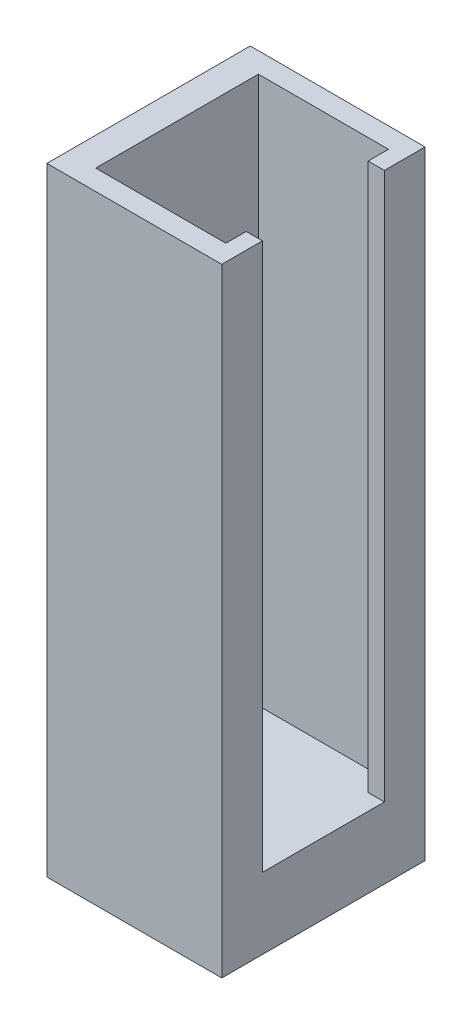
ISO-10303-21;
HEADER;
FILE_DESCRIPTION(('STEP AP214'),'2;1');
FILE_NAME('part.step','',(''),(''),'','','');
FILE_SCHEMA(('AUTOMOTIVE_DESIGN { 1 0 10303 214 1 1 1 1 }'));
ENDSEC;
DATA;
#1=APPLICATION_CONTEXT('core data for automotive mechanical design processes');
#2=APPLICATION_PROTOCOL_DEFINITION('international standard','automotive_design',2000,#1);
#3=PRODUCT_CONTEXT('',#1,'mechanical');
#4=PRODUCT('Part','Part','',(#3));
#5=PRODUCT_RELATED_PRODUCT_CATEGORY('part','',(#4));
#6=PRODUCT_DEFINITION_FORMATION('','',#4);
#7=PRODUCT_DEFINITION_CONTEXT('part definition',#1,'design');
#8=PRODUCT_DEFINITION('design','',#6,#7);
#9=PRODUCT_DEFINITION_SHAPE('','',#8);
#10=(LENGTH_UNIT() NAMED_UNIT(*) SI_UNIT(.MILLI.,.METRE.));
#11=(NAMED_UNIT(*) PLANE_ANGLE_UNIT() SI_UNIT($,.RADIAN.));
#12=(NAMED_UNIT(*) SI_UNIT($,.STERADIAN.) SOLID_ANGLE_UNIT());
#13=UNCERTAINTY_MEASURE_WITH_UNIT(LENGTH_MEASURE(1.E-05),#10,'distance_accuracy_value','');
#14=(GEOMETRIC_REPRESENTATION_CONTEXT(3) GLOBAL_UNCERTAINTY_ASSIGNED_CONTEXT((#13)) GLOBAL_UNIT_ASSIGNED_CONTEXT((#10,
#11,#12)) REPRESENTATION_CONTEXT('',''));
#15=CARTESIAN_POINT('',(0.,0.,0.));
#16=DIRECTION('',(0.,0.,1.));
#17=DIRECTION('',(1.,0.,0.));
#18=AXIS2_PLACEMENT_3D('',#15,#16,#17);
#19=CARTESIAN_POINT('',(-2.15,0.,2.5));
#20=DIRECTION('',(1.,0.,0.));
#21=DIRECTION('',(0.,0.,-1.));
#22=AXIS2_PLACEMENT_3D('',#19,#20,#21);
#23=PLANE('',#22);
#24=DIRECTION('',(0.,-1.,0.));
#25=VECTOR('',#24,1.);
#26=CARTESIAN_POINT('',(-2.15,0.,-2.5));
#27=LINE('',#26,#25);
#28=CARTESIAN_POINT('',(-2.15,15.2,-2.5));
#29=VERTEX_POINT('',#28);
#30=CARTESIAN_POINT('',(-2.15,0.,-2.5));
#31=VERTEX_POINT('',#30);
#32=EDGE_CURVE('E167',#29,#31,#27,.T.);
#33=ORIENTED_EDGE('',*,*,#32,.T.);
#34=DIRECTION('',(0.,0.,-1.));
#35=VECTOR('',#34,1.);
#36=CARTESIAN_POINT('',(-2.15,0.,2.5));
#37=LINE('',#36,#35);
#38=CARTESIAN_POINT('',(-2.15,0.,2.5));
#39=VERTEX_POINT('',#38);
#40=EDGE_CURVE('E11',#39,#31,#37,.T.);
#41=ORIENTED_EDGE('',*,*,#40,.F.);
#42=DIRECTION('',(0.,-1.,0.));
#43=VECTOR('',#42,1.);
#44=CARTESIAN_POINT('',(-2.15,0.,2.5));
#45=LINE('',#44,#43);
#46=CARTESIAN_POINT('',(-2.15,15.2,2.5));
#47=VERTEX_POINT('',#46);
#48=EDGE_CURVE('E161',#47,#39,#45,.T.);
#49=ORIENTED_EDGE('',*,*,#48,.F.);
#50=DIRECTION('',(0.,0.,-1.));
#51=VECTOR('',#50,1.);
#52=CARTESIAN_POINT('',(-2.15,15.2,2.5));
#53=LINE('',#52,#51);
#54=EDGE_CURVE('E157',#47,#29,#53,.T.);
#55=ORIENTED_EDGE('',*,*,#54,.T.);
#56=EDGE_LOOP('',(#33,#41,#49,#55));
#57=FACE_BOUND('',#56,.T.);
#58=ADVANCED_FACE('F36',(#57),#23,.F.);
#59=CARTESIAN_POINT('',(-2.15,0.,2.5));
#60=DIRECTION('',(0.,1.,0.));
#61=DIRECTION('',(-1.,0.,0.));
#62=AXIS2_PLACEMENT_3D('',#59,#60,#61);
#63=PLANE('',#62);
#64=DIRECTION('',(1.,0.,0.));
#65=VECTOR('',#64,1.);
#66=CARTESIAN_POINT('',(-2.15,0.,-2.5));
#67=LINE('',#66,#65);
#68=CARTESIAN_POINT('',(2.15,0.,-2.5));
#69=VERTEX_POINT('',#68);
#70=EDGE_CURVE('E165',#31,#69,#67,.T.);
#71=ORIENTED_EDGE('',*,*,#70,.T.);
#72=DIRECTION('',(0.,0.,-1.));
#73=VECTOR('',#72,1.);
#74=CARTESIAN_POINT('',(2.15,0.,2.5));
#75=LINE('',#74,#73);
#76=CARTESIAN_POINT('',(2.15,0.,2.5));
#77=VERTEX_POINT('',#76);
#78=EDGE_CURVE('E43',#77,#69,#75,.T.);
#79=ORIENTED_EDGE('',*,*,#78,.F.);
#80=DIRECTION('',(1.,0.,0.));
#81=VECTOR('',#80,1.);
#82=CARTESIAN_POINT('',(-2.15,0.,2.5));
#83=LINE('',#82,#81);
#84=EDGE_CURVE('E86',#39,#77,#83,.T.);
#85=ORIENTED_EDGE('',*,*,#84,.F.);
#86=ORIENTED_EDGE('',*,*,#40,.T.);
#87=EDGE_LOOP('',(#71,#79,#85,#86));
#88=FACE_BOUND('',#87,.T.);
#89=ADVANCED_FACE('F249',(#88),#63,.F.);
#90=CARTESIAN_POINT('',(2.15,0.,2.5));
#91=DIRECTION('',(-1.,0.,0.));
#92=DIRECTION('',(0.,0.,1.));
#93=AXIS2_PLACEMENT_3D('',#90,#91,#92);
#94=PLANE('',#93);
#95=DIRECTION('',(0.,0.,-1.));
#96=VECTOR('',#95,1.);
#97=CARTESIAN_POINT('',(2.15,15.2,2.5));
#98=LINE('',#97,#96);
#99=CARTESIAN_POINT('',(2.15,15.2,-1.5));
#100=VERTEX_POINT('',#99);
#101=CARTESIAN_POINT('',(2.15,15.2,-2.5));
#102=VERTEX_POINT('',#101);
#103=EDGE_CURVE('E154',#100,#102,#98,.T.);
#104=ORIENTED_EDGE('',*,*,#103,.F.);
#105=DIRECTION('',(0.,-1.,0.));
#106=VECTOR('',#105,1.);
#107=CARTESIAN_POINT('',(2.15,15.2,-1.5));
#108=LINE('',#107,#106);
#109=CARTESIAN_POINT('',(2.15,1.75,-1.5));
#110=VERTEX_POINT('',#109);
#111=EDGE_CURVE('E170',#100,#110,#108,.T.);
#112=ORIENTED_EDGE('',*,*,#111,.T.);
#113=DIRECTION('',(0.,0.,1.));
#114=VECTOR('',#113,1.);
#115=CARTESIAN_POINT('',(2.15,1.75,-1.5));
#116=LINE('',#115,#114);
#117=CARTESIAN_POINT('',(2.15,1.75,1.5));
#118=VERTEX_POINT('',#117);
#119=EDGE_CURVE('E149',#110,#118,#116,.T.);
#120=ORIENTED_EDGE('',*,*,#119,.T.);
#121=DIRECTION('',(0.,-1.,0.));
#122=VECTOR('',#121,1.);
#123=CARTESIAN_POINT('',(2.15,15.2,1.5));
#124=LINE('',#123,#122);
#125=CARTESIAN_POINT('',(2.15,15.2,1.5));
#126=VERTEX_POINT('',#125);
#127=EDGE_CURVE('E135',#126,#118,#124,.T.);
#128=ORIENTED_EDGE('',*,*,#127,.F.);
#129=CARTESIAN_POINT('',(2.15,15.2,2.5));
#130=VERTEX_POINT('',#129);
#131=EDGE_CURVE('E147',#130,#126,#98,.T.);
#132=ORIENTED_EDGE('',*,*,#131,.F.);
#133=DIRECTION('',(0.,1.,0.));
#134=VECTOR('',#133,1.);
#135=CARTESIAN_POINT('',(2.15,0.,2.5));
#136=LINE('',#135,#134);
#137=EDGE_CURVE('E172',#77,#130,#136,.T.);
#138=ORIENTED_EDGE('',*,*,#137,.F.);
#139=ORIENTED_EDGE('',*,*,#78,.T.);
#140=DIRECTION('',(0.,1.,0.));
#141=VECTOR('',#140,1.);
#142=CARTESIAN_POINT('',(2.15,0.,-2.5));
#143=LINE('',#142,#141);
#144=EDGE_CURVE('E162',#69,#102,#143,.T.);
#145=ORIENTED_EDGE('',*,*,#144,.T.);
#146=EDGE_LOOP('',(#104,#112,#120,#128,#132,#138,#139,#145));
#147=FACE_BOUND('',#146,.T.);
#148=ADVANCED_FACE('F145',(#147),#94,.F.);
#149=CARTESIAN_POINT('',(-2.15,15.2,2.5));
#150=DIRECTION('',(0.,-1.,0.));
#151=DIRECTION('',(0.,0.,-1.));
#152=AXIS2_PLACEMENT_3D('',#149,#150,#151);
#153=PLANE('',#152);
#154=DIRECTION('',(0.,0.,1.));
#155=VECTOR('',#154,1.);
#156=CARTESIAN_POINT('',(1.75,15.2,-2.));
#157=LINE('',#156,#155);
#158=CARTESIAN_POINT('',(1.75,15.2,-2.));
#159=VERTEX_POINT('',#158);
#160=CARTESIAN_POINT('',(1.75,15.2,-1.5));
#161=VERTEX_POINT('',#160);
#162=EDGE_CURVE('E210',#159,#161,#157,.T.);
#163=ORIENTED_EDGE('',*,*,#162,.T.);
#164=DIRECTION('',(1.,0.,0.));
#165=VECTOR('',#164,1.);
#166=CARTESIAN_POINT('',(1.75,15.2,-1.5));
#167=LINE('',#166,#165);
#168=EDGE_CURVE('E150',#161,#100,#167,.T.);
#169=ORIENTED_EDGE('',*,*,#168,.T.);
#170=ORIENTED_EDGE('',*,*,#103,.T.);
#171=DIRECTION('',(-1.,0.,0.));
#172=VECTOR('',#171,1.);
#173=CARTESIAN_POINT('',(-2.15,15.2,-2.5));
#174=LINE('',#173,#172);
#175=EDGE_CURVE('E79',#102,#29,#174,.T.);
#176=ORIENTED_EDGE('',*,*,#175,.T.);
#177=ORIENTED_EDGE('',*,*,#54,.F.);
#178=DIRECTION('',(-1.,0.,0.));
#179=VECTOR('',#178,1.);
#180=CARTESIAN_POINT('',(-2.15,15.2,2.5));
#181=LINE('',#180,#179);
#182=EDGE_CURVE('E59',#130,#47,#181,.T.);
#183=ORIENTED_EDGE('',*,*,#182,.F.);
#184=ORIENTED_EDGE('',*,*,#131,.T.);
#185=DIRECTION('',(-1.,0.,0.));
#186=VECTOR('',#185,1.);
#187=CARTESIAN_POINT('',(2.15,15.2,1.5));
#188=LINE('',#187,#186);
#189=CARTESIAN_POINT('',(1.75,15.2,1.5));
#190=VERTEX_POINT('',#189);
#191=EDGE_CURVE('E131',#126,#190,#188,.T.);
#192=ORIENTED_EDGE('',*,*,#191,.T.);
#193=DIRECTION('',(0.,0.,1.));
#194=VECTOR('',#193,1.);
#195=CARTESIAN_POINT('',(1.75,15.2,1.5));
#196=LINE('',#195,#194);
#197=CARTESIAN_POINT('',(1.75,15.2,2.));
#198=VERTEX_POINT('',#197);
#199=EDGE_CURVE('E50',#190,#198,#196,.T.);
#200=ORIENTED_EDGE('',*,*,#199,.T.);
#201=DIRECTION('',(-1.,0.,0.));
#202=VECTOR('',#201,1.);
#203=CARTESIAN_POINT('',(1.75,15.2,2.));
#204=LINE('',#203,#202);
#205=CARTESIAN_POINT('',(-1.45,15.2,2.));
#206=VERTEX_POINT('',#205);
#207=EDGE_CURVE('E218',#198,#206,#204,.T.);
#208=ORIENTED_EDGE('',*,*,#207,.T.);
#209=DIRECTION('',(0.,0.,-1.));
#210=VECTOR('',#209,1.);
#211=CARTESIAN_POINT('',(-1.45,15.2,2.));
#212=LINE('',#211,#210);
#213=CARTESIAN_POINT('',(-1.45,15.2,-2.));
#214=VERTEX_POINT('',#213);
#215=EDGE_CURVE('E215',#206,#214,#212,.T.);
#216=ORIENTED_EDGE('',*,*,#215,.T.);
#217=DIRECTION('',(1.,0.,0.));
#218=VECTOR('',#217,1.);
#219=CARTESIAN_POINT('',(-1.45,15.2,-2.));
#220=LINE('',#219,#218);
#221=EDGE_CURVE('E212',#214,#159,#220,.T.);
#222=ORIENTED_EDGE('',*,*,#221,.T.);
#223=EDGE_LOOP('',(#163,#169,#170,#176,#177,#183,#184,#192,#200,#208,#216,#222));
#224=FACE_BOUND('',#223,.T.);
#225=ADVANCED_FACE('F153',(#224),#153,.F.);
#226=CARTESIAN_POINT('',(0.,0.,2.5));
#227=DIRECTION('',(0.,0.,-1.));
#228=DIRECTION('',(-1.,0.,0.));
#229=AXIS2_PLACEMENT_3D('',#226,#227,#228);
#230=PLANE('',#229);
#231=ORIENTED_EDGE('',*,*,#48,.T.);
#232=ORIENTED_EDGE('',*,*,#84,.T.);
#233=ORIENTED_EDGE('',*,*,#137,.T.);
#234=ORIENTED_EDGE('',*,*,#182,.T.);
#235=EDGE_LOOP('',(#231,#232,#233,#234));
#236=FACE_BOUND('',#235,.T.);
#237=ADVANCED_FACE('F248',(#236),#230,.F.);
#238=CARTESIAN_POINT('',(0.,0.,-2.5));
#239=DIRECTION('',(0.,0.,-1.));
#240=DIRECTION('',(-1.,0.,0.));
#241=AXIS2_PLACEMENT_3D('',#238,#239,#240);
#242=PLANE('',#241);
#243=ORIENTED_EDGE('',*,*,#32,.F.);
#244=ORIENTED_EDGE('',*,*,#175,.F.);
#245=ORIENTED_EDGE('',*,*,#144,.F.);
#246=ORIENTED_EDGE('',*,*,#70,.F.);
#247=EDGE_LOOP('',(#243,#244,#245,#246));
#248=FACE_BOUND('',#247,.T.);
#249=ADVANCED_FACE('F244',(#248),#242,.T.);
#250=CARTESIAN_POINT('',(1.75,15.2,-1.5));
#251=DIRECTION('',(0.,0.,-1.));
#252=DIRECTION('',(-1.,0.,0.));
#253=AXIS2_PLACEMENT_3D('',#250,#251,#252);
#254=PLANE('',#253);
#255=DIRECTION('',(1.,0.,0.));
#256=VECTOR('',#255,1.);
#257=CARTESIAN_POINT('',(1.75,1.75,-1.5));
#258=LINE('',#257,#256);
#259=CARTESIAN_POINT('',(1.75,1.75,-1.5));
#260=VERTEX_POINT('',#259);
#261=EDGE_CURVE('E139',#260,#110,#258,.T.);
#262=ORIENTED_EDGE('',*,*,#261,.T.);
#263=ORIENTED_EDGE('',*,*,#111,.F.);
#264=ORIENTED_EDGE('',*,*,#168,.F.);
#265=DIRECTION('',(0.,-1.,0.));
#266=VECTOR('',#265,1.);
#267=CARTESIAN_POINT('',(1.75,15.2,-1.5));
#268=LINE('',#267,#266);
#269=EDGE_CURVE('E185',#161,#260,#268,.T.);
#270=ORIENTED_EDGE('',*,*,#269,.T.);
#271=EDGE_LOOP('',(#262,#263,#264,#270));
#272=FACE_BOUND('',#271,.T.);
#273=ADVANCED_FACE('F240',(#272),#254,.F.);
#274=CARTESIAN_POINT('',(1.75,15.2,-2.));
#275=DIRECTION('',(1.,0.,0.));
#276=DIRECTION('',(0.,0.,-1.));
#277=AXIS2_PLACEMENT_3D('',#274,#275,#276);
#278=PLANE('',#277);
#279=DIRECTION('',(0.,0.,1.));
#280=VECTOR('',#279,1.);
#281=CARTESIAN_POINT('',(1.75,1.75,-2.));
#282=LINE('',#281,#280);
#283=CARTESIAN_POINT('',(1.75,1.75,-2.));
#284=VERTEX_POINT('',#283);
#285=EDGE_CURVE('E190',#284,#260,#282,.T.);
#286=ORIENTED_EDGE('',*,*,#285,.T.);
#287=ORIENTED_EDGE('',*,*,#269,.F.);
#288=ORIENTED_EDGE('',*,*,#162,.F.);
#289=DIRECTION('',(0.,-1.,0.));
#290=VECTOR('',#289,1.);
#291=CARTESIAN_POINT('',(1.75,15.2,-2.));
#292=LINE('',#291,#290);
#293=EDGE_CURVE('E183',#159,#284,#292,.T.);
#294=ORIENTED_EDGE('',*,*,#293,.T.);
#295=EDGE_LOOP('',(#286,#287,#288,#294));
#296=FACE_BOUND('',#295,.T.);
#297=ADVANCED_FACE('F236',(#296),#278,.F.);
#298=CARTESIAN_POINT('',(-1.45,15.2,-2.));
#299=DIRECTION('',(0.,0.,-1.));
#300=DIRECTION('',(-1.,0.,0.));
#301=AXIS2_PLACEMENT_3D('',#298,#299,#300);
#302=PLANE('',#301);
#303=DIRECTION('',(1.,0.,0.));
#304=VECTOR('',#303,1.);
#305=CARTESIAN_POINT('',(-1.45,1.75,-2.));
#306=LINE('',#305,#304);
#307=CARTESIAN_POINT('',(-1.45,1.75,-2.));
#308=VERTEX_POINT('',#307);
#309=EDGE_CURVE('E193',#308,#284,#306,.T.);
#310=ORIENTED_EDGE('',*,*,#309,.T.);
#311=ORIENTED_EDGE('',*,*,#293,.F.);
#312=ORIENTED_EDGE('',*,*,#221,.F.);
#313=DIRECTION('',(0.,-1.,0.));
#314=VECTOR('',#313,1.);
#315=CARTESIAN_POINT('',(-1.45,15.2,-2.));
#316=LINE('',#315,#314);
#317=EDGE_CURVE('E181',#214,#308,#316,.T.);
#318=ORIENTED_EDGE('',*,*,#317,.T.);
#319=EDGE_LOOP('',(#310,#311,#312,#318));
#320=FACE_BOUND('',#319,.T.);
#321=ADVANCED_FACE('F232',(#320),#302,.F.);
#322=CARTESIAN_POINT('',(-1.45,15.2,2.));
#323=DIRECTION('',(-1.,0.,0.));
#324=DIRECTION('',(0.,-1.,0.));
#325=AXIS2_PLACEMENT_3D('',#322,#323,#324);
#326=PLANE('',#325);
#327=DIRECTION('',(0.,0.,-1.));
#328=VECTOR('',#327,1.);
#329=CARTESIAN_POINT('',(-1.45,1.75,2.));
#330=LINE('',#329,#328);
#331=CARTESIAN_POINT('',(-1.45,1.75,2.));
#332=VERTEX_POINT('',#331);
#333=EDGE_CURVE('E196',#332,#308,#330,.T.);
#334=ORIENTED_EDGE('',*,*,#333,.T.);
#335=ORIENTED_EDGE('',*,*,#317,.F.);
#336=ORIENTED_EDGE('',*,*,#215,.F.);
#337=DIRECTION('',(0.,-1.,0.));
#338=VECTOR('',#337,1.);
#339=CARTESIAN_POINT('',(-1.45,15.2,2.));
#340=LINE('',#339,#338);
#341=EDGE_CURVE('E179',#206,#332,#340,.T.);
#342=ORIENTED_EDGE('',*,*,#341,.T.);
#343=EDGE_LOOP('',(#334,#335,#336,#342));
#344=FACE_BOUND('',#343,.T.);
#345=ADVANCED_FACE('F228',(#344),#326,.F.);
#346=CARTESIAN_POINT('',(1.75,15.2,2.));
#347=DIRECTION('',(0.,0.,1.));
#348=DIRECTION('',(1.,0.,0.));
#349=AXIS2_PLACEMENT_3D('',#346,#347,#348);
#350=PLANE('',#349);
#351=DIRECTION('',(-1.,0.,0.));
#352=VECTOR('',#351,1.);
#353=CARTESIAN_POINT('',(1.75,1.75,2.));
#354=LINE('',#353,#352);
#355=CARTESIAN_POINT('',(1.75,1.75,2.));
#356=VERTEX_POINT('',#355);
#357=EDGE_CURVE('E199',#356,#332,#354,.T.);
#358=ORIENTED_EDGE('',*,*,#357,.T.);
#359=ORIENTED_EDGE('',*,*,#341,.F.);
#360=ORIENTED_EDGE('',*,*,#207,.F.);
#361=DIRECTION('',(0.,-1.,0.));
#362=VECTOR('',#361,1.);
#363=CARTESIAN_POINT('',(1.75,15.2,2.));
#364=LINE('',#363,#362);
#365=EDGE_CURVE('E177',#198,#356,#364,.T.);
#366=ORIENTED_EDGE('',*,*,#365,.T.);
#367=EDGE_LOOP('',(#358,#359,#360,#366));
#368=FACE_BOUND('',#367,.T.);
#369=ADVANCED_FACE('F224',(#368),#350,.F.);
#370=CARTESIAN_POINT('',(1.75,15.2,1.5));
#371=DIRECTION('',(1.,0.,0.));
#372=DIRECTION('',(0.,0.,-1.));
#373=AXIS2_PLACEMENT_3D('',#370,#371,#372);
#374=PLANE('',#373);
#375=DIRECTION('',(0.,0.,1.));
#376=VECTOR('',#375,1.);
#377=CARTESIAN_POINT('',(1.75,1.75,1.5));
#378=LINE('',#377,#376);
#379=CARTESIAN_POINT('',(1.75,1.75,1.5));
#380=VERTEX_POINT('',#379);
#381=EDGE_CURVE('E202',#380,#356,#378,.T.);
#382=ORIENTED_EDGE('',*,*,#381,.T.);
#383=ORIENTED_EDGE('',*,*,#365,.F.);
#384=ORIENTED_EDGE('',*,*,#199,.F.);
#385=DIRECTION('',(0.,-1.,0.));
#386=VECTOR('',#385,1.);
#387=CARTESIAN_POINT('',(1.75,15.2,1.5));
#388=LINE('',#387,#386);
#389=EDGE_CURVE('E137',#190,#380,#388,.T.);
#390=ORIENTED_EDGE('',*,*,#389,.T.);
#391=EDGE_LOOP('',(#382,#383,#384,#390));
#392=FACE_BOUND('',#391,.T.);
#393=ADVANCED_FACE('F266',(#392),#374,.F.);
#394=CARTESIAN_POINT('',(2.15,15.2,1.5));
#395=DIRECTION('',(0.,0.,1.));
#396=DIRECTION('',(1.,0.,0.));
#397=AXIS2_PLACEMENT_3D('',#394,#395,#396);
#398=PLANE('',#397);
#399=DIRECTION('',(-1.,0.,0.));
#400=VECTOR('',#399,1.);
#401=CARTESIAN_POINT('',(2.15,1.75,1.5));
#402=LINE('',#401,#400);
#403=EDGE_CURVE('E205',#118,#380,#402,.T.);
#404=ORIENTED_EDGE('',*,*,#403,.T.);
#405=ORIENTED_EDGE('',*,*,#389,.F.);
#406=ORIENTED_EDGE('',*,*,#191,.F.);
#407=ORIENTED_EDGE('',*,*,#127,.T.);
#408=EDGE_LOOP('',(#404,#405,#406,#407));
#409=FACE_BOUND('',#408,.T.);
#410=ADVANCED_FACE('F134',(#409),#398,.F.);
#411=CARTESIAN_POINT('',(0.,1.75,0.));
#412=DIRECTION('',(0.,-1.,0.));
#413=DIRECTION('',(1.,0.,0.));
#414=AXIS2_PLACEMENT_3D('',#411,#412,#413);
#415=PLANE('',#414);
#416=ORIENTED_EDGE('',*,*,#119,.F.);
#417=ORIENTED_EDGE('',*,*,#261,.F.);
#418=ORIENTED_EDGE('',*,*,#285,.F.);
#419=ORIENTED_EDGE('',*,*,#309,.F.);
#420=ORIENTED_EDGE('',*,*,#333,.F.);
#421=ORIENTED_EDGE('',*,*,#357,.F.);
#422=ORIENTED_EDGE('',*,*,#381,.F.);
#423=ORIENTED_EDGE('',*,*,#403,.F.);
#424=EDGE_LOOP('',(#416,#417,#418,#419,#420,#421,#422,#423));
#425=FACE_BOUND('',#424,.T.);
#426=ADVANCED_FACE('F265',(#425),#415,.F.);
#427=CLOSED_SHELL('',(#58,#89,#148,#225,#237,#249,#273,#297,#321,#345,#369,#393,#410,#426));
#428=MANIFOLD_SOLID_BREP('B2',#427);
#429=ADVANCED_BREP_SHAPE_REPRESENTATION('',(#18,#428),#14);
#430=SHAPE_DEFINITION_REPRESENTATION(#9,#429);
ENDSEC;
END-ISO-10303-21;
